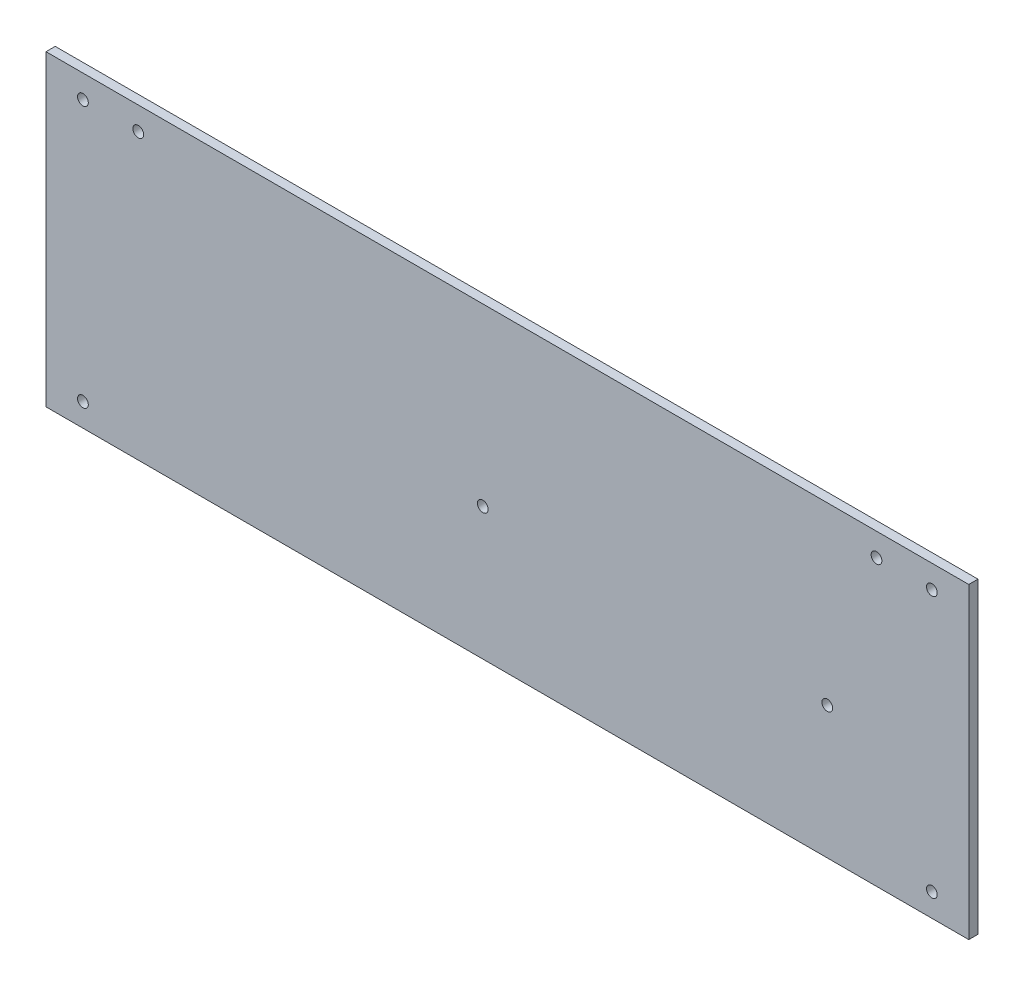
ISO-10303-21;
HEADER;
FILE_DESCRIPTION(('STEP AP214'),'2;1');
FILE_NAME('part.step','',(''),(''),'','','');
FILE_SCHEMA(('AUTOMOTIVE_DESIGN { 1 0 10303 214 1 1 1 1 }'));
ENDSEC;
DATA;
#1=APPLICATION_CONTEXT('core data for automotive mechanical design processes');
#2=APPLICATION_PROTOCOL_DEFINITION('international standard','automotive_design',2000,#1);
#3=PRODUCT_CONTEXT('',#1,'mechanical');
#4=PRODUCT('Part','Part','',(#3));
#5=PRODUCT_RELATED_PRODUCT_CATEGORY('part','',(#4));
#6=PRODUCT_DEFINITION_FORMATION('','',#4);
#7=PRODUCT_DEFINITION_CONTEXT('part definition',#1,'design');
#8=PRODUCT_DEFINITION('design','',#6,#7);
#9=PRODUCT_DEFINITION_SHAPE('','',#8);
#10=(LENGTH_UNIT() NAMED_UNIT(*) SI_UNIT(.MILLI.,.METRE.));
#11=(NAMED_UNIT(*) PLANE_ANGLE_UNIT() SI_UNIT($,.RADIAN.));
#12=(NAMED_UNIT(*) SI_UNIT($,.STERADIAN.) SOLID_ANGLE_UNIT());
#13=UNCERTAINTY_MEASURE_WITH_UNIT(LENGTH_MEASURE(1.E-05),#10,'distance_accuracy_value','');
#14=(GEOMETRIC_REPRESENTATION_CONTEXT(3) GLOBAL_UNCERTAINTY_ASSIGNED_CONTEXT((#13)) GLOBAL_UNIT_ASSIGNED_CONTEXT((#10,
#11,#12)) REPRESENTATION_CONTEXT('',''));
#15=CARTESIAN_POINT('',(0.,0.,0.));
#16=DIRECTION('',(0.,0.,1.));
#17=DIRECTION('',(1.,0.,0.));
#18=AXIS2_PLACEMENT_3D('',#15,#16,#17);
#19=CARTESIAN_POINT('',(0.,0.,3.));
#20=DIRECTION('',(1.,0.,0.));
#21=DIRECTION('',(0.,0.,-1.));
#22=AXIS2_PLACEMENT_3D('',#19,#20,#21);
#23=PLANE('',#22);
#24=DIRECTION('',(0.,-1.,0.));
#25=VECTOR('',#24,1.);
#26=CARTESIAN_POINT('',(0.,0.,0.));
#27=LINE('',#26,#25);
#28=CARTESIAN_POINT('',(0.,100.,0.));
#29=VERTEX_POINT('',#28);
#30=CARTESIAN_POINT('',(0.,0.,0.));
#31=VERTEX_POINT('',#30);
#32=EDGE_CURVE('E99',#29,#31,#27,.T.);
#33=ORIENTED_EDGE('',*,*,#32,.T.);
#34=DIRECTION('',(0.,0.,-1.));
#35=VECTOR('',#34,1.);
#36=CARTESIAN_POINT('',(0.,0.,3.));
#37=LINE('',#36,#35);
#38=CARTESIAN_POINT('',(0.,0.,3.));
#39=VERTEX_POINT('',#38);
#40=EDGE_CURVE('E11',#39,#31,#37,.T.);
#41=ORIENTED_EDGE('',*,*,#40,.F.);
#42=DIRECTION('',(0.,-1.,0.));
#43=VECTOR('',#42,1.);
#44=CARTESIAN_POINT('',(0.,0.,3.));
#45=LINE('',#44,#43);
#46=CARTESIAN_POINT('',(0.,100.,3.));
#47=VERTEX_POINT('',#46);
#48=EDGE_CURVE('E86',#47,#39,#45,.T.);
#49=ORIENTED_EDGE('',*,*,#48,.F.);
#50=DIRECTION('',(0.,0.,-1.));
#51=VECTOR('',#50,1.);
#52=CARTESIAN_POINT('',(0.,100.,3.));
#53=LINE('',#52,#51);
#54=EDGE_CURVE('E95',#47,#29,#53,.T.);
#55=ORIENTED_EDGE('',*,*,#54,.T.);
#56=EDGE_LOOP('',(#33,#41,#49,#55));
#57=FACE_BOUND('',#56,.T.);
#58=ADVANCED_FACE('F33',(#57),#23,.F.);
#59=CARTESIAN_POINT('',(0.,0.,3.));
#60=DIRECTION('',(0.,1.,0.));
#61=DIRECTION('',(0.,0.,1.));
#62=AXIS2_PLACEMENT_3D('',#59,#60,#61);
#63=PLANE('',#62);
#64=DIRECTION('',(1.,0.,0.));
#65=VECTOR('',#64,1.);
#66=CARTESIAN_POINT('',(0.,0.,0.));
#67=LINE('',#66,#65);
#68=CARTESIAN_POINT('',(300.,0.,0.));
#69=VERTEX_POINT('',#68);
#70=EDGE_CURVE('E90',#31,#69,#67,.T.);
#71=ORIENTED_EDGE('',*,*,#70,.T.);
#72=DIRECTION('',(0.,0.,-1.));
#73=VECTOR('',#72,1.);
#74=CARTESIAN_POINT('',(300.,0.,3.));
#75=LINE('',#74,#73);
#76=CARTESIAN_POINT('',(300.,0.,3.));
#77=VERTEX_POINT('',#76);
#78=EDGE_CURVE('E42',#77,#69,#75,.T.);
#79=ORIENTED_EDGE('',*,*,#78,.F.);
#80=DIRECTION('',(1.,0.,0.));
#81=VECTOR('',#80,1.);
#82=CARTESIAN_POINT('',(0.,0.,3.));
#83=LINE('',#82,#81);
#84=EDGE_CURVE('E81',#39,#77,#83,.T.);
#85=ORIENTED_EDGE('',*,*,#84,.F.);
#86=ORIENTED_EDGE('',*,*,#40,.T.);
#87=EDGE_LOOP('',(#71,#79,#85,#86));
#88=FACE_BOUND('',#87,.T.);
#89=ADVANCED_FACE('F89',(#88),#63,.F.);
#90=CARTESIAN_POINT('',(300.,0.,3.));
#91=DIRECTION('',(-1.,0.,0.));
#92=DIRECTION('',(0.,0.,1.));
#93=AXIS2_PLACEMENT_3D('',#90,#91,#92);
#94=PLANE('',#93);
#95=DIRECTION('',(0.,1.,0.));
#96=VECTOR('',#95,1.);
#97=CARTESIAN_POINT('',(300.,0.,0.));
#98=LINE('',#97,#96);
#99=CARTESIAN_POINT('',(300.,100.,0.));
#100=VERTEX_POINT('',#99);
#101=EDGE_CURVE('E68',#69,#100,#98,.T.);
#102=ORIENTED_EDGE('',*,*,#101,.T.);
#103=DIRECTION('',(0.,0.,-1.));
#104=VECTOR('',#103,1.);
#105=CARTESIAN_POINT('',(300.,100.,3.));
#106=LINE('',#105,#104);
#107=CARTESIAN_POINT('',(300.,100.,3.));
#108=VERTEX_POINT('',#107);
#109=EDGE_CURVE('E91',#108,#100,#106,.T.);
#110=ORIENTED_EDGE('',*,*,#109,.F.);
#111=DIRECTION('',(0.,1.,0.));
#112=VECTOR('',#111,1.);
#113=CARTESIAN_POINT('',(300.,0.,3.));
#114=LINE('',#113,#112);
#115=EDGE_CURVE('E84',#77,#108,#114,.T.);
#116=ORIENTED_EDGE('',*,*,#115,.F.);
#117=ORIENTED_EDGE('',*,*,#78,.T.);
#118=EDGE_LOOP('',(#102,#110,#116,#117));
#119=FACE_BOUND('',#118,.T.);
#120=ADVANCED_FACE('F93',(#119),#94,.F.);
#121=CARTESIAN_POINT('',(0.,100.,3.));
#122=DIRECTION('',(0.,-1.,0.));
#123=DIRECTION('',(0.,0.,-1.));
#124=AXIS2_PLACEMENT_3D('',#121,#122,#123);
#125=PLANE('',#124);
#126=DIRECTION('',(-1.,0.,0.));
#127=VECTOR('',#126,1.);
#128=CARTESIAN_POINT('',(0.,100.,0.));
#129=LINE('',#128,#127);
#130=EDGE_CURVE('E74',#100,#29,#129,.T.);
#131=ORIENTED_EDGE('',*,*,#130,.T.);
#132=ORIENTED_EDGE('',*,*,#54,.F.);
#133=DIRECTION('',(-1.,0.,0.));
#134=VECTOR('',#133,1.);
#135=CARTESIAN_POINT('',(0.,100.,3.));
#136=LINE('',#135,#134);
#137=EDGE_CURVE('E51',#108,#47,#136,.T.);
#138=ORIENTED_EDGE('',*,*,#137,.F.);
#139=ORIENTED_EDGE('',*,*,#109,.T.);
#140=EDGE_LOOP('',(#131,#132,#138,#139));
#141=FACE_BOUND('',#140,.T.);
#142=ADVANCED_FACE('F180',(#141),#125,.F.);
#143=CARTESIAN_POINT('',(0.,0.,3.));
#144=DIRECTION('',(0.,0.,-1.));
#145=DIRECTION('',(-1.,0.,0.));
#146=AXIS2_PLACEMENT_3D('',#143,#144,#145);
#147=PLANE('',#146);
#148=CARTESIAN_POINT('',(270.,92.5,3.));
#149=DIRECTION('',(0.,0.,-1.));
#150=DIRECTION('',(-1.,0.,0.));
#151=AXIS2_PLACEMENT_3D('',#148,#149,#150);
#152=CIRCLE('',#151,1.74999999999998);
#153=CARTESIAN_POINT('',(268.25,92.5,3.));
#154=VERTEX_POINT('',#153);
#155=EDGE_CURVE('E126',#154,#154,#152,.T.);
#156=ORIENTED_EDGE('',*,*,#155,.T.);
#157=EDGE_LOOP('',(#156));
#158=FACE_BOUND('',#157,.T.);
#159=CARTESIAN_POINT('',(288.,7.50000000000001,3.));
#160=DIRECTION('',(0.,0.,-1.));
#161=DIRECTION('',(-1.,0.,0.));
#162=AXIS2_PLACEMENT_3D('',#159,#160,#161);
#163=CIRCLE('',#162,1.74999999999998);
#164=CARTESIAN_POINT('',(286.25,7.50000000000001,3.));
#165=VERTEX_POINT('',#164);
#166=EDGE_CURVE('E129',#165,#165,#163,.T.);
#167=ORIENTED_EDGE('',*,*,#166,.T.);
#168=EDGE_LOOP('',(#167));
#169=FACE_BOUND('',#168,.T.);
#170=CARTESIAN_POINT('',(12.,7.50000000000004,3.));
#171=DIRECTION('',(0.,0.,-1.));
#172=DIRECTION('',(-1.,0.,0.));
#173=AXIS2_PLACEMENT_3D('',#170,#171,#172);
#174=CIRCLE('',#173,1.74999999999998);
#175=CARTESIAN_POINT('',(10.25,7.50000000000004,3.));
#176=VERTEX_POINT('',#175);
#177=EDGE_CURVE('E132',#176,#176,#174,.T.);
#178=ORIENTED_EDGE('',*,*,#177,.T.);
#179=EDGE_LOOP('',(#178));
#180=FACE_BOUND('',#179,.T.);
#181=CARTESIAN_POINT('',(12.,92.5,3.));
#182=DIRECTION('',(0.,0.,-1.));
#183=DIRECTION('',(-1.,0.,0.));
#184=AXIS2_PLACEMENT_3D('',#181,#182,#183);
#185=CIRCLE('',#184,1.74999999999998);
#186=CARTESIAN_POINT('',(10.25,92.5,3.));
#187=VERTEX_POINT('',#186);
#188=EDGE_CURVE('E135',#187,#187,#185,.T.);
#189=ORIENTED_EDGE('',*,*,#188,.T.);
#190=EDGE_LOOP('',(#189));
#191=FACE_BOUND('',#190,.T.);
#192=CARTESIAN_POINT('',(30.,92.5,3.));
#193=DIRECTION('',(0.,0.,-1.));
#194=DIRECTION('',(-1.,0.,0.));
#195=AXIS2_PLACEMENT_3D('',#192,#193,#194);
#196=CIRCLE('',#195,1.74999999999998);
#197=CARTESIAN_POINT('',(28.25,92.5,3.));
#198=VERTEX_POINT('',#197);
#199=EDGE_CURVE('E138',#198,#198,#196,.T.);
#200=ORIENTED_EDGE('',*,*,#199,.T.);
#201=EDGE_LOOP('',(#200));
#202=FACE_BOUND('',#201,.T.);
#203=CARTESIAN_POINT('',(288.,92.5,3.));
#204=DIRECTION('',(0.,0.,-1.));
#205=DIRECTION('',(-1.,0.,0.));
#206=AXIS2_PLACEMENT_3D('',#203,#204,#205);
#207=CIRCLE('',#206,1.74999999999998);
#208=CARTESIAN_POINT('',(286.25,92.5,3.));
#209=VERTEX_POINT('',#208);
#210=EDGE_CURVE('E120',#209,#209,#207,.T.);
#211=ORIENTED_EDGE('',*,*,#210,.T.);
#212=EDGE_LOOP('',(#211));
#213=FACE_BOUND('',#212,.T.);
#214=CARTESIAN_POINT('',(254.,43.,3.));
#215=DIRECTION('',(0.,0.,1.));
#216=DIRECTION('',(-1.,0.,0.));
#217=AXIS2_PLACEMENT_3D('',#214,#215,#216);
#218=CIRCLE('',#217,1.75000000000004);
#219=CARTESIAN_POINT('',(252.25,43.,3.));
#220=VERTEX_POINT('',#219);
#221=EDGE_CURVE('E116',#220,#220,#218,.T.);
#222=ORIENTED_EDGE('',*,*,#221,.F.);
#223=EDGE_LOOP('',(#222));
#224=FACE_BOUND('',#223,.T.);
#225=CARTESIAN_POINT('',(142.,43.,3.));
#226=DIRECTION('',(0.,0.,1.));
#227=DIRECTION('',(1.,0.,0.));
#228=AXIS2_PLACEMENT_3D('',#225,#226,#227);
#229=CIRCLE('',#228,1.75000000000001);
#230=CARTESIAN_POINT('',(143.75,43.,3.));
#231=VERTEX_POINT('',#230);
#232=EDGE_CURVE('E108',#231,#231,#229,.T.);
#233=ORIENTED_EDGE('',*,*,#232,.F.);
#234=EDGE_LOOP('',(#233));
#235=FACE_BOUND('',#234,.T.);
#236=ORIENTED_EDGE('',*,*,#48,.T.);
#237=ORIENTED_EDGE('',*,*,#84,.T.);
#238=ORIENTED_EDGE('',*,*,#115,.T.);
#239=ORIENTED_EDGE('',*,*,#137,.T.);
#240=EDGE_LOOP('',(#236,#237,#238,#239));
#241=FACE_BOUND('',#240,.T.);
#242=ADVANCED_FACE('F82',(#158,#169,#180,#191,#202,#213,#224,#235,#241),#147,.F.);
#243=CARTESIAN_POINT('',(0.,0.,0.));
#244=DIRECTION('',(0.,0.,-1.));
#245=DIRECTION('',(-1.,0.,0.));
#246=AXIS2_PLACEMENT_3D('',#243,#244,#245);
#247=PLANE('',#246);
#248=CARTESIAN_POINT('',(270.,92.5,0.));
#249=DIRECTION('',(0.,0.,-1.));
#250=DIRECTION('',(-1.,0.,0.));
#251=AXIS2_PLACEMENT_3D('',#248,#249,#250);
#252=CIRCLE('',#251,1.74999999999998);
#253=CARTESIAN_POINT('',(268.25,92.5,0.));
#254=VERTEX_POINT('',#253);
#255=EDGE_CURVE('E141',#254,#254,#252,.T.);
#256=ORIENTED_EDGE('',*,*,#255,.F.);
#257=EDGE_LOOP('',(#256));
#258=FACE_BOUND('',#257,.T.);
#259=CARTESIAN_POINT('',(288.,7.50000000000001,0.));
#260=DIRECTION('',(0.,0.,-1.));
#261=DIRECTION('',(1.,0.,0.));
#262=AXIS2_PLACEMENT_3D('',#259,#260,#261);
#263=CIRCLE('',#262,1.74999999999998);
#264=CARTESIAN_POINT('',(289.75,7.50000000000001,0.));
#265=VERTEX_POINT('',#264);
#266=EDGE_CURVE('E151',#265,#265,#263,.T.);
#267=ORIENTED_EDGE('',*,*,#266,.F.);
#268=EDGE_LOOP('',(#267));
#269=FACE_BOUND('',#268,.T.);
#270=CARTESIAN_POINT('',(12.,7.50000000000004,0.));
#271=DIRECTION('',(0.,0.,-1.));
#272=DIRECTION('',(-1.,0.,0.));
#273=AXIS2_PLACEMENT_3D('',#270,#271,#272);
#274=CIRCLE('',#273,1.74999999999998);
#275=CARTESIAN_POINT('',(10.25,7.50000000000004,0.));
#276=VERTEX_POINT('',#275);
#277=EDGE_CURVE('E148',#276,#276,#274,.T.);
#278=ORIENTED_EDGE('',*,*,#277,.F.);
#279=EDGE_LOOP('',(#278));
#280=FACE_BOUND('',#279,.T.);
#281=CARTESIAN_POINT('',(12.,92.5,0.));
#282=DIRECTION('',(0.,0.,-1.));
#283=DIRECTION('',(1.,0.,0.));
#284=AXIS2_PLACEMENT_3D('',#281,#282,#283);
#285=CIRCLE('',#284,1.74999999999998);
#286=CARTESIAN_POINT('',(13.75,92.5,0.));
#287=VERTEX_POINT('',#286);
#288=EDGE_CURVE('E145',#287,#287,#285,.T.);
#289=ORIENTED_EDGE('',*,*,#288,.F.);
#290=EDGE_LOOP('',(#289));
#291=FACE_BOUND('',#290,.T.);
#292=CARTESIAN_POINT('',(30.,92.5,0.));
#293=DIRECTION('',(0.,0.,-1.));
#294=DIRECTION('',(1.,0.,0.));
#295=AXIS2_PLACEMENT_3D('',#292,#293,#294);
#296=CIRCLE('',#295,1.74999999999998);
#297=CARTESIAN_POINT('',(31.75,92.5,0.));
#298=VERTEX_POINT('',#297);
#299=EDGE_CURVE('E142',#298,#298,#296,.T.);
#300=ORIENTED_EDGE('',*,*,#299,.F.);
#301=EDGE_LOOP('',(#300));
#302=FACE_BOUND('',#301,.T.);
#303=CARTESIAN_POINT('',(288.,92.5,0.));
#304=DIRECTION('',(0.,0.,-1.));
#305=DIRECTION('',(-1.,0.,0.));
#306=AXIS2_PLACEMENT_3D('',#303,#304,#305);
#307=CIRCLE('',#306,1.74999999999998);
#308=CARTESIAN_POINT('',(286.25,92.5,0.));
#309=VERTEX_POINT('',#308);
#310=EDGE_CURVE('E123',#309,#309,#307,.T.);
#311=ORIENTED_EDGE('',*,*,#310,.F.);
#312=EDGE_LOOP('',(#311));
#313=FACE_BOUND('',#312,.T.);
#314=CARTESIAN_POINT('',(254.,43.,0.));
#315=DIRECTION('',(0.,0.,-1.));
#316=DIRECTION('',(-1.,0.,0.));
#317=AXIS2_PLACEMENT_3D('',#314,#315,#316);
#318=CIRCLE('',#317,1.75000000000004);
#319=CARTESIAN_POINT('',(252.25,43.,0.));
#320=VERTEX_POINT('',#319);
#321=EDGE_CURVE('E36',#320,#320,#318,.T.);
#322=ORIENTED_EDGE('',*,*,#321,.F.);
#323=EDGE_LOOP('',(#322));
#324=FACE_BOUND('',#323,.T.);
#325=CARTESIAN_POINT('',(142.,43.,0.));
#326=DIRECTION('',(0.,0.,-1.));
#327=DIRECTION('',(-1.,0.,0.));
#328=AXIS2_PLACEMENT_3D('',#325,#326,#327);
#329=CIRCLE('',#328,1.75000000000001);
#330=CARTESIAN_POINT('',(140.25,43.,0.));
#331=VERTEX_POINT('',#330);
#332=EDGE_CURVE('E102',#331,#331,#329,.T.);
#333=ORIENTED_EDGE('',*,*,#332,.F.);
#334=EDGE_LOOP('',(#333));
#335=FACE_BOUND('',#334,.T.);
#336=ORIENTED_EDGE('',*,*,#32,.F.);
#337=ORIENTED_EDGE('',*,*,#130,.F.);
#338=ORIENTED_EDGE('',*,*,#101,.F.);
#339=ORIENTED_EDGE('',*,*,#70,.F.);
#340=EDGE_LOOP('',(#336,#337,#338,#339));
#341=FACE_BOUND('',#340,.T.);
#342=ADVANCED_FACE('F160',(#258,#269,#280,#291,#302,#313,#324,#335,#341),#247,.T.);
#343=CARTESIAN_POINT('',(142.,43.,-27.));
#344=DIRECTION('',(0.,0.,1.));
#345=DIRECTION('',(1.,0.,0.));
#346=AXIS2_PLACEMENT_3D('',#343,#344,#345);
#347=CYLINDRICAL_SURFACE('',#346,1.75000000000001);
#348=ORIENTED_EDGE('',*,*,#332,.T.);
#349=EDGE_LOOP('',(#348));
#350=FACE_BOUND('',#349,.T.);
#351=ORIENTED_EDGE('',*,*,#232,.T.);
#352=EDGE_LOOP('',(#351));
#353=FACE_BOUND('',#352,.T.);
#354=ADVANCED_FACE('F163',(#350,#353),#347,.F.);
#355=CARTESIAN_POINT('',(254.,43.,-27.));
#356=DIRECTION('',(0.,0.,1.));
#357=DIRECTION('',(1.,0.,0.));
#358=AXIS2_PLACEMENT_3D('',#355,#356,#357);
#359=CYLINDRICAL_SURFACE('',#358,1.75000000000004);
#360=ORIENTED_EDGE('',*,*,#321,.T.);
#361=EDGE_LOOP('',(#360));
#362=FACE_BOUND('',#361,.T.);
#363=ORIENTED_EDGE('',*,*,#221,.T.);
#364=EDGE_LOOP('',(#363));
#365=FACE_BOUND('',#364,.T.);
#366=ADVANCED_FACE('F215',(#362,#365),#359,.F.);
#367=CARTESIAN_POINT('',(288.,92.5,10.));
#368=DIRECTION('',(0.,0.,-1.));
#369=DIRECTION('',(-1.,0.,0.));
#370=AXIS2_PLACEMENT_3D('',#367,#368,#369);
#371=CYLINDRICAL_SURFACE('',#370,1.74999999999998);
#372=ORIENTED_EDGE('',*,*,#310,.T.);
#373=EDGE_LOOP('',(#372));
#374=FACE_BOUND('',#373,.T.);
#375=ORIENTED_EDGE('',*,*,#210,.F.);
#376=EDGE_LOOP('',(#375));
#377=FACE_BOUND('',#376,.T.);
#378=ADVANCED_FACE('F225',(#374,#377),#371,.F.);
#379=CARTESIAN_POINT('',(30.,92.5,10.));
#380=DIRECTION('',(0.,0.,-1.));
#381=DIRECTION('',(-1.,0.,0.));
#382=AXIS2_PLACEMENT_3D('',#379,#380,#381);
#383=CYLINDRICAL_SURFACE('',#382,1.74999999999998);
#384=ORIENTED_EDGE('',*,*,#299,.T.);
#385=EDGE_LOOP('',(#384));
#386=FACE_BOUND('',#385,.T.);
#387=ORIENTED_EDGE('',*,*,#199,.F.);
#388=EDGE_LOOP('',(#387));
#389=FACE_BOUND('',#388,.T.);
#390=ADVANCED_FACE('F240',(#386,#389),#383,.F.);
#391=CARTESIAN_POINT('',(12.,92.5,10.));
#392=DIRECTION('',(0.,0.,-1.));
#393=DIRECTION('',(-1.,0.,0.));
#394=AXIS2_PLACEMENT_3D('',#391,#392,#393);
#395=CYLINDRICAL_SURFACE('',#394,1.74999999999998);
#396=ORIENTED_EDGE('',*,*,#288,.T.);
#397=EDGE_LOOP('',(#396));
#398=FACE_BOUND('',#397,.T.);
#399=ORIENTED_EDGE('',*,*,#188,.F.);
#400=EDGE_LOOP('',(#399));
#401=FACE_BOUND('',#400,.T.);
#402=ADVANCED_FACE('F250',(#398,#401),#395,.F.);
#403=CARTESIAN_POINT('',(12.,7.50000000000004,10.));
#404=DIRECTION('',(0.,0.,-1.));
#405=DIRECTION('',(-1.,0.,0.));
#406=AXIS2_PLACEMENT_3D('',#403,#404,#405);
#407=CYLINDRICAL_SURFACE('',#406,1.74999999999998);
#408=ORIENTED_EDGE('',*,*,#277,.T.);
#409=EDGE_LOOP('',(#408));
#410=FACE_BOUND('',#409,.T.);
#411=ORIENTED_EDGE('',*,*,#177,.F.);
#412=EDGE_LOOP('',(#411));
#413=FACE_BOUND('',#412,.T.);
#414=ADVANCED_FACE('F260',(#410,#413),#407,.F.);
#415=CARTESIAN_POINT('',(288.,7.50000000000001,10.));
#416=DIRECTION('',(0.,0.,-1.));
#417=DIRECTION('',(-1.,0.,0.));
#418=AXIS2_PLACEMENT_3D('',#415,#416,#417);
#419=CYLINDRICAL_SURFACE('',#418,1.74999999999998);
#420=ORIENTED_EDGE('',*,*,#266,.T.);
#421=EDGE_LOOP('',(#420));
#422=FACE_BOUND('',#421,.T.);
#423=ORIENTED_EDGE('',*,*,#166,.F.);
#424=EDGE_LOOP('',(#423));
#425=FACE_BOUND('',#424,.T.);
#426=ADVANCED_FACE('F270',(#422,#425),#419,.F.);
#427=CARTESIAN_POINT('',(270.,92.5,10.));
#428=DIRECTION('',(0.,0.,-1.));
#429=DIRECTION('',(-1.,0.,0.));
#430=AXIS2_PLACEMENT_3D('',#427,#428,#429);
#431=CYLINDRICAL_SURFACE('',#430,1.74999999999998);
#432=ORIENTED_EDGE('',*,*,#255,.T.);
#433=EDGE_LOOP('',(#432));
#434=FACE_BOUND('',#433,.T.);
#435=ORIENTED_EDGE('',*,*,#155,.F.);
#436=EDGE_LOOP('',(#435));
#437=FACE_BOUND('',#436,.T.);
#438=ADVANCED_FACE('F157',(#434,#437),#431,.F.);
#439=CLOSED_SHELL('',(#58,#89,#120,#142,#242,#342,#354,#366,#378,#390,#402,#414,#426,#438));
#440=MANIFOLD_SOLID_BREP('B2',#439);
#441=ADVANCED_BREP_SHAPE_REPRESENTATION('',(#18,#440),#14);
#442=SHAPE_DEFINITION_REPRESENTATION(#9,#441);
ENDSEC;
END-ISO-10303-21;
